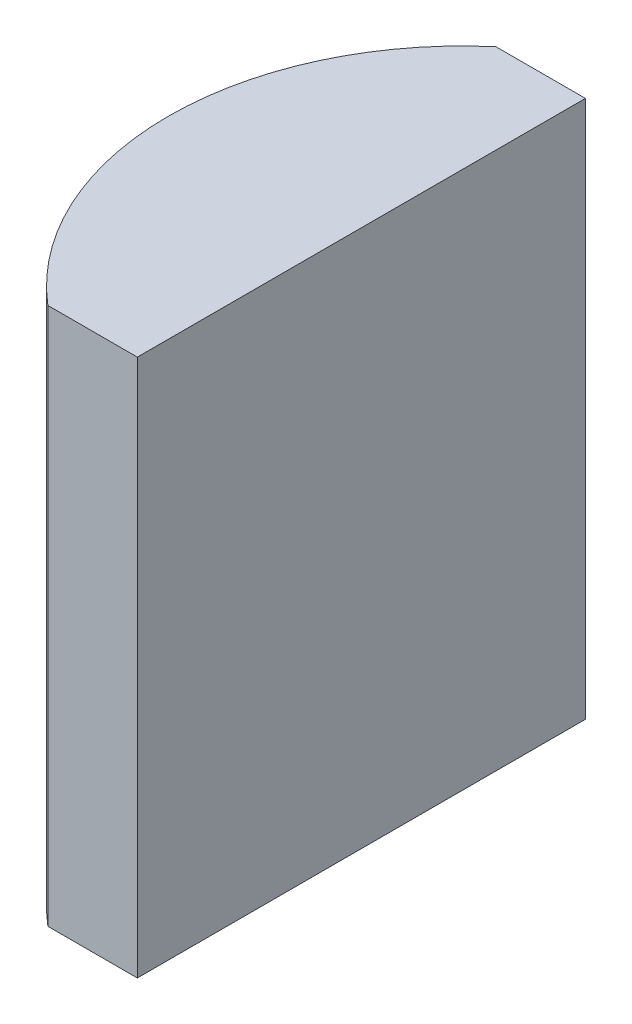
ISO-10303-21;
HEADER;
FILE_DESCRIPTION(('STEP AP214'),'2;1');
FILE_NAME('part.step','',(''),(''),'','','');
FILE_SCHEMA(('AUTOMOTIVE_DESIGN { 1 0 10303 214 1 1 1 1 }'));
ENDSEC;
DATA;
#1=APPLICATION_CONTEXT('core data for automotive mechanical design processes');
#2=APPLICATION_PROTOCOL_DEFINITION('international standard','automotive_design',2000,#1);
#3=PRODUCT_CONTEXT('',#1,'mechanical');
#4=PRODUCT('Part','Part','',(#3));
#5=PRODUCT_RELATED_PRODUCT_CATEGORY('part','',(#4));
#6=PRODUCT_DEFINITION_FORMATION('','',#4);
#7=PRODUCT_DEFINITION_CONTEXT('part definition',#1,'design');
#8=PRODUCT_DEFINITION('design','',#6,#7);
#9=PRODUCT_DEFINITION_SHAPE('','',#8);
#10=(LENGTH_UNIT() NAMED_UNIT(*) SI_UNIT(.MILLI.,.METRE.));
#11=(NAMED_UNIT(*) PLANE_ANGLE_UNIT() SI_UNIT($,.RADIAN.));
#12=(NAMED_UNIT(*) SI_UNIT($,.STERADIAN.) SOLID_ANGLE_UNIT());
#13=UNCERTAINTY_MEASURE_WITH_UNIT(LENGTH_MEASURE(1.E-05),#10,'distance_accuracy_value','');
#14=(GEOMETRIC_REPRESENTATION_CONTEXT(3) GLOBAL_UNCERTAINTY_ASSIGNED_CONTEXT((#13)) GLOBAL_UNIT_ASSIGNED_CONTEXT((#10,
#11,#12)) REPRESENTATION_CONTEXT('',''));
#15=CARTESIAN_POINT('',(0.,0.,0.));
#16=DIRECTION('',(0.,0.,1.));
#17=DIRECTION('',(1.,0.,0.));
#18=AXIS2_PLACEMENT_3D('',#15,#16,#17);
#19=CARTESIAN_POINT('',(4.35520433485127,12.,0.));
#20=DIRECTION('',(0.,-1.,0.));
#21=DIRECTION('',(0.,0.,-1.));
#22=AXIS2_PLACEMENT_3D('',#19,#20,#21);
#23=CYLINDRICAL_SURFACE('',#22,6.56000000000001);
#24=CARTESIAN_POINT('',(4.35520433485127,0.,0.));
#25=DIRECTION('',(0.,1.,0.));
#26=DIRECTION('',(0.,0.,1.));
#27=AXIS2_PLACEMENT_3D('',#24,#25,#26);
#28=CIRCLE('',#27,6.56000000000001);
#29=CARTESIAN_POINT('',(0.108605695940333,0.,-5.));
#30=VERTEX_POINT('',#29);
#31=CARTESIAN_POINT('',(0.108605695940333,0.,5.));
#32=VERTEX_POINT('',#31);
#33=EDGE_CURVE('E100',#30,#32,#28,.T.);
#34=ORIENTED_EDGE('',*,*,#33,.T.);
#35=DIRECTION('',(0.,-1.,0.));
#36=VECTOR('',#35,1.);
#37=CARTESIAN_POINT('',(0.108605695940333,12.,5.));
#38=LINE('',#37,#36);
#39=CARTESIAN_POINT('',(0.108605695940333,12.,5.));
#40=VERTEX_POINT('',#39);
#41=EDGE_CURVE('E11',#40,#32,#38,.T.);
#42=ORIENTED_EDGE('',*,*,#41,.F.);
#43=CARTESIAN_POINT('',(4.35520433485127,12.,0.));
#44=DIRECTION('',(0.,1.,0.));
#45=DIRECTION('',(0.,0.,1.));
#46=AXIS2_PLACEMENT_3D('',#43,#44,#45);
#47=CIRCLE('',#46,6.56000000000001);
#48=CARTESIAN_POINT('',(0.108605695940333,12.,-5.));
#49=VERTEX_POINT('',#48);
#50=EDGE_CURVE('E88',#49,#40,#47,.T.);
#51=ORIENTED_EDGE('',*,*,#50,.F.);
#52=DIRECTION('',(0.,-1.,0.));
#53=VECTOR('',#52,1.);
#54=CARTESIAN_POINT('',(0.108605695940333,12.,-5.));
#55=LINE('',#54,#53);
#56=EDGE_CURVE('E96',#49,#30,#55,.T.);
#57=ORIENTED_EDGE('',*,*,#56,.T.);
#58=EDGE_LOOP('',(#34,#42,#51,#57));
#59=FACE_BOUND('',#58,.T.);
#60=ADVANCED_FACE('F37',(#59),#23,.T.);
#61=CARTESIAN_POINT('',(0.108605695940333,12.,5.));
#62=DIRECTION('',(0.,0.,-1.));
#63=DIRECTION('',(-1.,0.,0.));
#64=AXIS2_PLACEMENT_3D('',#61,#62,#63);
#65=PLANE('',#64);
#66=DIRECTION('',(1.,0.,0.));
#67=VECTOR('',#66,1.);
#68=CARTESIAN_POINT('',(0.108605695940333,0.,5.));
#69=LINE('',#68,#67);
#70=CARTESIAN_POINT('',(2.10520433485127,0.,5.));
#71=VERTEX_POINT('',#70);
#72=EDGE_CURVE('E92',#32,#71,#69,.T.);
#73=ORIENTED_EDGE('',*,*,#72,.T.);
#74=DIRECTION('',(0.,-1.,0.));
#75=VECTOR('',#74,1.);
#76=CARTESIAN_POINT('',(2.10520433485127,12.,5.));
#77=LINE('',#76,#75);
#78=CARTESIAN_POINT('',(2.10520433485127,12.,5.));
#79=VERTEX_POINT('',#78);
#80=EDGE_CURVE('E45',#79,#71,#77,.T.);
#81=ORIENTED_EDGE('',*,*,#80,.F.);
#82=DIRECTION('',(1.,0.,0.));
#83=VECTOR('',#82,1.);
#84=CARTESIAN_POINT('',(0.108605695940333,12.,5.));
#85=LINE('',#84,#83);
#86=EDGE_CURVE('E83',#40,#79,#85,.T.);
#87=ORIENTED_EDGE('',*,*,#86,.F.);
#88=ORIENTED_EDGE('',*,*,#41,.T.);
#89=EDGE_LOOP('',(#73,#81,#87,#88));
#90=FACE_BOUND('',#89,.T.);
#91=ADVANCED_FACE('F91',(#90),#65,.F.);
#92=CARTESIAN_POINT('',(2.10520433485126,12.,-5.));
#93=DIRECTION('',(-1.,0.,0.));
#94=DIRECTION('',(0.,0.,1.));
#95=AXIS2_PLACEMENT_3D('',#92,#93,#94);
#96=PLANE('',#95);
#97=DIRECTION('',(0.,0.,-1.));
#98=VECTOR('',#97,1.);
#99=CARTESIAN_POINT('',(2.10520433485126,0.,-5.));
#100=LINE('',#99,#98);
#101=CARTESIAN_POINT('',(2.10520433485126,0.,-5.));
#102=VERTEX_POINT('',#101);
#103=EDGE_CURVE('E70',#71,#102,#100,.T.);
#104=ORIENTED_EDGE('',*,*,#103,.T.);
#105=DIRECTION('',(0.,-1.,0.));
#106=VECTOR('',#105,1.);
#107=CARTESIAN_POINT('',(2.10520433485126,12.,-5.));
#108=LINE('',#107,#106);
#109=CARTESIAN_POINT('',(2.10520433485126,12.,-5.));
#110=VERTEX_POINT('',#109);
#111=EDGE_CURVE('E93',#110,#102,#108,.T.);
#112=ORIENTED_EDGE('',*,*,#111,.F.);
#113=DIRECTION('',(0.,0.,-1.));
#114=VECTOR('',#113,1.);
#115=CARTESIAN_POINT('',(2.10520433485126,12.,-5.));
#116=LINE('',#115,#114);
#117=EDGE_CURVE('E86',#79,#110,#116,.T.);
#118=ORIENTED_EDGE('',*,*,#117,.F.);
#119=ORIENTED_EDGE('',*,*,#80,.T.);
#120=EDGE_LOOP('',(#104,#112,#118,#119));
#121=FACE_BOUND('',#120,.T.);
#122=ADVANCED_FACE('F94',(#121),#96,.F.);
#123=CARTESIAN_POINT('',(0.108605695940333,12.,-5.));
#124=DIRECTION('',(0.,0.,1.));
#125=DIRECTION('',(1.,0.,0.));
#126=AXIS2_PLACEMENT_3D('',#123,#124,#125);
#127=PLANE('',#126);
#128=DIRECTION('',(-1.,0.,0.));
#129=VECTOR('',#128,1.);
#130=CARTESIAN_POINT('',(0.108605695940333,0.,-5.));
#131=LINE('',#130,#129);
#132=EDGE_CURVE('E76',#102,#30,#131,.T.);
#133=ORIENTED_EDGE('',*,*,#132,.T.);
#134=ORIENTED_EDGE('',*,*,#56,.F.);
#135=DIRECTION('',(-1.,0.,0.));
#136=VECTOR('',#135,1.);
#137=CARTESIAN_POINT('',(0.108605695940333,12.,-5.));
#138=LINE('',#137,#136);
#139=EDGE_CURVE('E53',#110,#49,#138,.T.);
#140=ORIENTED_EDGE('',*,*,#139,.F.);
#141=ORIENTED_EDGE('',*,*,#111,.T.);
#142=EDGE_LOOP('',(#133,#134,#140,#141));
#143=FACE_BOUND('',#142,.T.);
#144=ADVANCED_FACE('F107',(#143),#127,.F.);
#145=CARTESIAN_POINT('',(4.35520433485127,12.,0.));
#146=DIRECTION('',(0.,1.,0.));
#147=DIRECTION('',(0.,0.,1.));
#148=AXIS2_PLACEMENT_3D('',#145,#146,#147);
#149=PLANE('',#148);
#150=ORIENTED_EDGE('',*,*,#50,.T.);
#151=ORIENTED_EDGE('',*,*,#86,.T.);
#152=ORIENTED_EDGE('',*,*,#117,.T.);
#153=ORIENTED_EDGE('',*,*,#139,.T.);
#154=EDGE_LOOP('',(#150,#151,#152,#153));
#155=FACE_BOUND('',#154,.T.);
#156=ADVANCED_FACE('F84',(#155),#149,.T.);
#157=CARTESIAN_POINT('',(4.35520433485127,0.,0.));
#158=DIRECTION('',(0.,1.,0.));
#159=DIRECTION('',(0.,0.,1.));
#160=AXIS2_PLACEMENT_3D('',#157,#158,#159);
#161=PLANE('',#160);
#162=ORIENTED_EDGE('',*,*,#33,.F.);
#163=ORIENTED_EDGE('',*,*,#132,.F.);
#164=ORIENTED_EDGE('',*,*,#103,.F.);
#165=ORIENTED_EDGE('',*,*,#72,.F.);
#166=EDGE_LOOP('',(#162,#163,#164,#165));
#167=FACE_BOUND('',#166,.T.);
#168=ADVANCED_FACE('F110',(#167),#161,.F.);
#169=CLOSED_SHELL('',(#60,#91,#122,#144,#156,#168));
#170=MANIFOLD_SOLID_BREP('B2',#169);
#171=ADVANCED_BREP_SHAPE_REPRESENTATION('',(#18,#170),#14);
#172=SHAPE_DEFINITION_REPRESENTATION(#9,#171);
ENDSEC;
END-ISO-10303-21;
